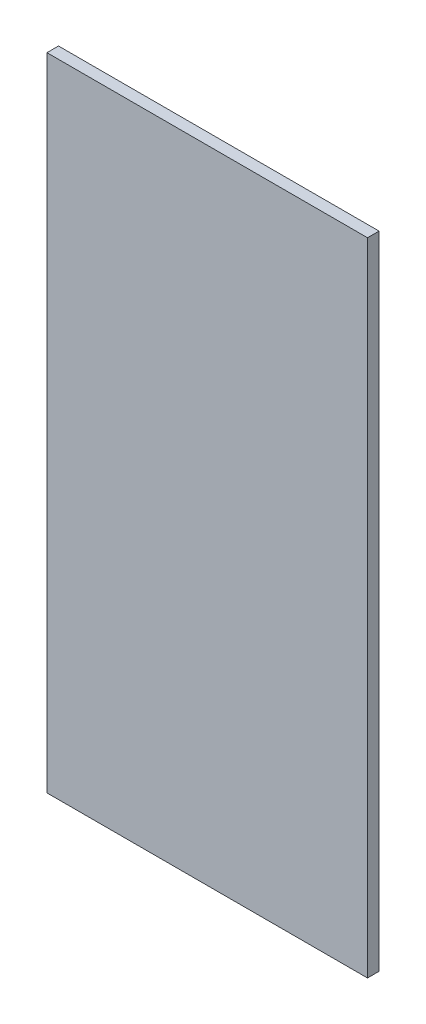
ISO-10303-21;
HEADER;
FILE_DESCRIPTION(('STEP AP214'),'2;1');
FILE_NAME('part.step','',(''),(''),'','','');
FILE_SCHEMA(('AUTOMOTIVE_DESIGN { 1 0 10303 214 1 1 1 1 }'));
ENDSEC;
DATA;
#1=APPLICATION_CONTEXT('core data for automotive mechanical design processes');
#2=APPLICATION_PROTOCOL_DEFINITION('international standard','automotive_design',2000,#1);
#3=PRODUCT_CONTEXT('',#1,'mechanical');
#4=PRODUCT('Part','Part','',(#3));
#5=PRODUCT_RELATED_PRODUCT_CATEGORY('part','',(#4));
#6=PRODUCT_DEFINITION_FORMATION('','',#4);
#7=PRODUCT_DEFINITION_CONTEXT('part definition',#1,'design');
#8=PRODUCT_DEFINITION('design','',#6,#7);
#9=PRODUCT_DEFINITION_SHAPE('','',#8);
#10=(LENGTH_UNIT() NAMED_UNIT(*) SI_UNIT(.MILLI.,.METRE.));
#11=(NAMED_UNIT(*) PLANE_ANGLE_UNIT() SI_UNIT($,.RADIAN.));
#12=(NAMED_UNIT(*) SI_UNIT($,.STERADIAN.) SOLID_ANGLE_UNIT());
#13=UNCERTAINTY_MEASURE_WITH_UNIT(LENGTH_MEASURE(1.E-05),#10,'distance_accuracy_value','');
#14=(GEOMETRIC_REPRESENTATION_CONTEXT(3) GLOBAL_UNCERTAINTY_ASSIGNED_CONTEXT((#13)) GLOBAL_UNIT_ASSIGNED_CONTEXT((#10,
#11,#12)) REPRESENTATION_CONTEXT('',''));
#15=CARTESIAN_POINT('',(0.,0.,0.));
#16=DIRECTION('',(0.,0.,1.));
#17=DIRECTION('',(1.,0.,0.));
#18=AXIS2_PLACEMENT_3D('',#15,#16,#17);
#19=CARTESIAN_POINT('',(1.625,-0.5,-0.018));
#20=DIRECTION('',(-1.,0.,0.));
#21=DIRECTION('',(0.,0.,-1.));
#22=AXIS2_PLACEMENT_3D('',#19,#20,#21);
#23=PLANE('',#22);
#24=CARTESIAN_POINT('',(1.625,-0.5,-0.018));
#25=CARTESIAN_POINT('',(1.625,-1.5,-0.018));
#26=B_SPLINE_CURVE_WITH_KNOTS('',1,(#24,#25),.UNSPECIFIED.,.F.,.F.,(2,2),(0.,1.),.UNSPECIFIED.);
#27=CARTESIAN_POINT('',(1.625,-0.5,-0.018));
#28=VERTEX_POINT('',#27);
#29=CARTESIAN_POINT('',(1.625,-1.5,-0.018));
#30=VERTEX_POINT('',#29);
#31=EDGE_CURVE('E11',#28,#30,#26,.T.);
#32=ORIENTED_EDGE('',*,*,#31,.T.);
#33=CARTESIAN_POINT('',(1.625,-1.5,-0.018));
#34=CARTESIAN_POINT('',(1.625,-1.5,0.));
#35=B_SPLINE_CURVE_WITH_KNOTS('',1,(#33,#34),.UNSPECIFIED.,.F.,.F.,(2,2),(0.,0.018),.UNSPECIFIED.);
#36=CARTESIAN_POINT('',(1.625,-1.5,0.));
#37=VERTEX_POINT('',#36);
#38=EDGE_CURVE('E26',#30,#37,#35,.T.);
#39=ORIENTED_EDGE('',*,*,#38,.T.);
#40=CARTESIAN_POINT('',(1.625,-0.5,0.));
#41=CARTESIAN_POINT('',(1.625,-1.5,0.));
#42=B_SPLINE_CURVE_WITH_KNOTS('',1,(#40,#41),.UNSPECIFIED.,.F.,.F.,(2,2),(0.,1.),.UNSPECIFIED.);
#43=CARTESIAN_POINT('',(1.625,-0.5,0.));
#44=VERTEX_POINT('',#43);
#45=EDGE_CURVE('E132',#44,#37,#42,.T.);
#46=ORIENTED_EDGE('',*,*,#45,.F.);
#47=CARTESIAN_POINT('',(1.625,-0.5,-0.018));
#48=CARTESIAN_POINT('',(1.625,-0.5,0.));
#49=B_SPLINE_CURVE_WITH_KNOTS('',1,(#47,#48),.UNSPECIFIED.,.F.,.F.,(2,2),(0.,0.018),.UNSPECIFIED.);
#50=EDGE_CURVE('E79',#28,#44,#49,.T.);
#51=ORIENTED_EDGE('',*,*,#50,.F.);
#52=EDGE_LOOP('',(#32,#39,#46,#51));
#53=FACE_BOUND('',#52,.T.);
#54=ADVANCED_FACE('F17',(#53),#23,.T.);
#55=CARTESIAN_POINT('',(1.625,-1.5,-0.018));
#56=DIRECTION('',(0.,-1.,0.));
#57=DIRECTION('',(0.,0.,-1.));
#58=AXIS2_PLACEMENT_3D('',#55,#56,#57);
#59=PLANE('',#58);
#60=CARTESIAN_POINT('',(1.625,-1.5,-0.018));
#61=CARTESIAN_POINT('',(2.125,-1.5,-0.018));
#62=B_SPLINE_CURVE_WITH_KNOTS('',1,(#60,#61),.UNSPECIFIED.,.F.,.F.,(2,2),(1.,1.5),.UNSPECIFIED.);
#63=CARTESIAN_POINT('',(2.125,-1.5,-0.018));
#64=VERTEX_POINT('',#63);
#65=EDGE_CURVE('E119',#30,#64,#62,.T.);
#66=ORIENTED_EDGE('',*,*,#65,.T.);
#67=CARTESIAN_POINT('',(2.125,-1.5,-0.018));
#68=CARTESIAN_POINT('',(2.125,-1.5,0.));
#69=B_SPLINE_CURVE_WITH_KNOTS('',1,(#67,#68),.UNSPECIFIED.,.F.,.F.,(2,2),(0.,0.018),.UNSPECIFIED.);
#70=CARTESIAN_POINT('',(2.125,-1.5,0.));
#71=VERTEX_POINT('',#70);
#72=EDGE_CURVE('E112',#64,#71,#69,.T.);
#73=ORIENTED_EDGE('',*,*,#72,.T.);
#74=CARTESIAN_POINT('',(1.625,-1.5,0.));
#75=CARTESIAN_POINT('',(2.125,-1.5,0.));
#76=B_SPLINE_CURVE_WITH_KNOTS('',1,(#74,#75),.UNSPECIFIED.,.F.,.F.,(2,2),(1.,1.5),.UNSPECIFIED.);
#77=EDGE_CURVE('E74',#37,#71,#76,.T.);
#78=ORIENTED_EDGE('',*,*,#77,.F.);
#79=ORIENTED_EDGE('',*,*,#38,.F.);
#80=EDGE_LOOP('',(#66,#73,#78,#79));
#81=FACE_BOUND('',#80,.T.);
#82=ADVANCED_FACE('F147',(#81),#59,.T.);
#83=CARTESIAN_POINT('',(2.125,-1.5,-0.018));
#84=DIRECTION('',(1.,0.,0.));
#85=DIRECTION('',(0.,0.,1.));
#86=AXIS2_PLACEMENT_3D('',#83,#84,#85);
#87=PLANE('',#86);
#88=CARTESIAN_POINT('',(2.125,-1.5,-0.018));
#89=CARTESIAN_POINT('',(2.125,-0.5,-0.018));
#90=B_SPLINE_CURVE_WITH_KNOTS('',1,(#88,#89),.UNSPECIFIED.,.F.,.F.,(2,2),(1.5,2.5),.UNSPECIFIED.);
#91=CARTESIAN_POINT('',(2.125,-0.5,-0.018));
#92=VERTEX_POINT('',#91);
#93=EDGE_CURVE('E62',#64,#92,#90,.T.);
#94=ORIENTED_EDGE('',*,*,#93,.T.);
#95=CARTESIAN_POINT('',(2.125,-0.5,-0.018));
#96=CARTESIAN_POINT('',(2.125,-0.5,0.));
#97=B_SPLINE_CURVE_WITH_KNOTS('',1,(#95,#96),.UNSPECIFIED.,.F.,.F.,(2,2),(0.,0.018),.UNSPECIFIED.);
#98=CARTESIAN_POINT('',(2.125,-0.5,0.));
#99=VERTEX_POINT('',#98);
#100=EDGE_CURVE('E56',#92,#99,#97,.T.);
#101=ORIENTED_EDGE('',*,*,#100,.T.);
#102=CARTESIAN_POINT('',(2.125,-1.5,0.));
#103=CARTESIAN_POINT('',(2.125,-0.5,0.));
#104=B_SPLINE_CURVE_WITH_KNOTS('',1,(#102,#103),.UNSPECIFIED.,.F.,.F.,(2,2),(1.5,2.5),.UNSPECIFIED.);
#105=EDGE_CURVE('E60',#71,#99,#104,.T.);
#106=ORIENTED_EDGE('',*,*,#105,.F.);
#107=ORIENTED_EDGE('',*,*,#72,.F.);
#108=EDGE_LOOP('',(#94,#101,#106,#107));
#109=FACE_BOUND('',#108,.T.);
#110=ADVANCED_FACE('F58',(#109),#87,.T.);
#111=CARTESIAN_POINT('',(2.125,-0.5,-0.018));
#112=DIRECTION('',(0.,1.,0.));
#113=DIRECTION('',(0.,0.,1.));
#114=AXIS2_PLACEMENT_3D('',#111,#112,#113);
#115=PLANE('',#114);
#116=CARTESIAN_POINT('',(2.125,-0.5,-0.018));
#117=CARTESIAN_POINT('',(1.625,-0.5,-0.018));
#118=B_SPLINE_CURVE_WITH_KNOTS('',1,(#116,#117),.UNSPECIFIED.,.F.,.F.,(2,2),(2.5,3.),.UNSPECIFIED.);
#119=EDGE_CURVE('E75',#92,#28,#118,.T.);
#120=ORIENTED_EDGE('',*,*,#119,.T.);
#121=ORIENTED_EDGE('',*,*,#50,.T.);
#122=CARTESIAN_POINT('',(2.125,-0.5,0.));
#123=CARTESIAN_POINT('',(1.625,-0.5,0.));
#124=B_SPLINE_CURVE_WITH_KNOTS('',1,(#122,#123),.UNSPECIFIED.,.F.,.F.,(2,2),(2.5,3.),.UNSPECIFIED.);
#125=EDGE_CURVE('E72',#99,#44,#124,.T.);
#126=ORIENTED_EDGE('',*,*,#125,.F.);
#127=ORIENTED_EDGE('',*,*,#100,.F.);
#128=EDGE_LOOP('',(#120,#121,#126,#127));
#129=FACE_BOUND('',#128,.T.);
#130=ADVANCED_FACE('F78',(#129),#115,.T.);
#131=CARTESIAN_POINT('',(1.625,-1.5,-0.018));
#132=DIRECTION('',(0.,0.,-1.));
#133=DIRECTION('',(-1.,0.,0.));
#134=AXIS2_PLACEMENT_3D('',#131,#132,#133);
#135=PLANE('',#134);
#136=ORIENTED_EDGE('',*,*,#119,.F.);
#137=ORIENTED_EDGE('',*,*,#93,.F.);
#138=ORIENTED_EDGE('',*,*,#65,.F.);
#139=ORIENTED_EDGE('',*,*,#31,.F.);
#140=EDGE_LOOP('',(#136,#137,#138,#139));
#141=FACE_BOUND('',#140,.T.);
#142=ADVANCED_FACE('F148',(#141),#135,.T.);
#143=CARTESIAN_POINT('',(1.625,-1.5,0.));
#144=DIRECTION('',(0.,0.,1.));
#145=DIRECTION('',(1.,0.,0.));
#146=AXIS2_PLACEMENT_3D('',#143,#144,#145);
#147=PLANE('',#146);
#148=ORIENTED_EDGE('',*,*,#45,.T.);
#149=ORIENTED_EDGE('',*,*,#77,.T.);
#150=ORIENTED_EDGE('',*,*,#105,.T.);
#151=ORIENTED_EDGE('',*,*,#125,.T.);
#152=EDGE_LOOP('',(#148,#149,#150,#151));
#153=FACE_BOUND('',#152,.T.);
#154=ADVANCED_FACE('F71',(#153),#147,.T.);
#155=CLOSED_SHELL('',(#54,#82,#110,#130,#142,#154));
#156=MANIFOLD_SOLID_BREP('B1',#155);
#157=ADVANCED_BREP_SHAPE_REPRESENTATION('',(#18,#156),#14);
#158=SHAPE_DEFINITION_REPRESENTATION(#9,#157);
ENDSEC;
END-ISO-10303-21;
